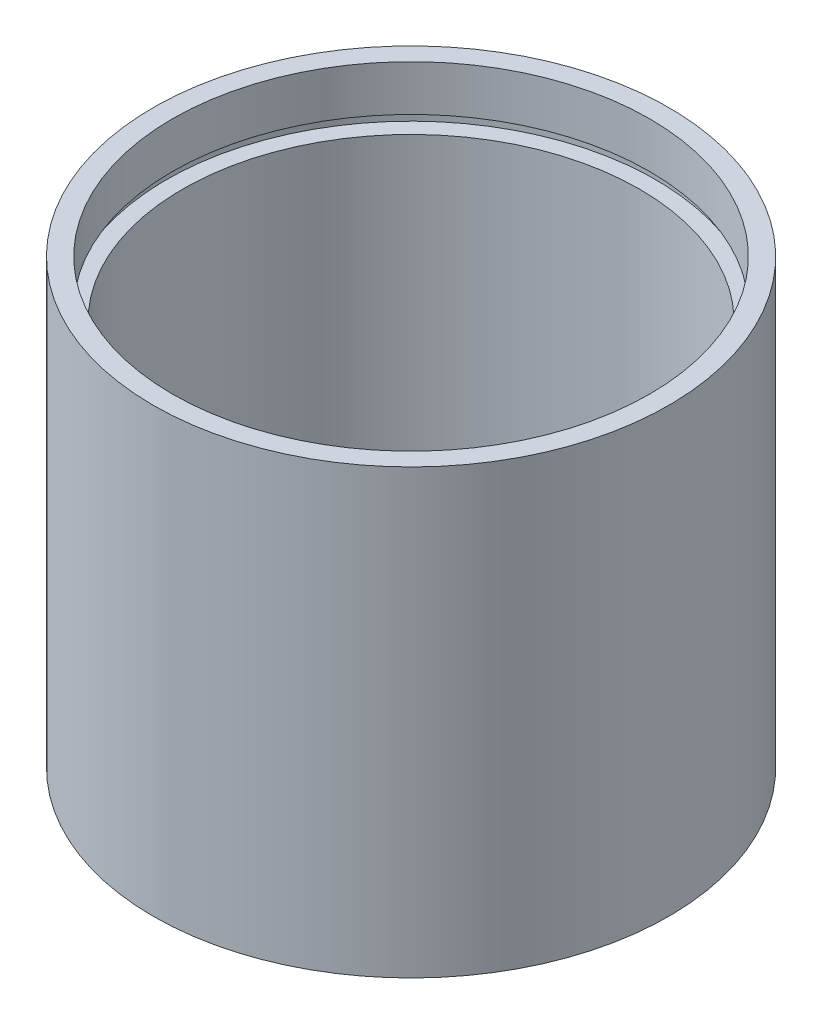
ISO-10303-21;
HEADER;
FILE_DESCRIPTION(('STEP AP214'),'2;1');
FILE_NAME('part.step','',(''),(''),'','','');
FILE_SCHEMA(('AUTOMOTIVE_DESIGN { 1 0 10303 214 1 1 1 1 }'));
ENDSEC;
DATA;
#1=APPLICATION_CONTEXT('core data for automotive mechanical design processes');
#2=APPLICATION_PROTOCOL_DEFINITION('international standard','automotive_design',2000,#1);
#3=PRODUCT_CONTEXT('',#1,'mechanical');
#4=PRODUCT('Part','Part','',(#3));
#5=PRODUCT_RELATED_PRODUCT_CATEGORY('part','',(#4));
#6=PRODUCT_DEFINITION_FORMATION('','',#4);
#7=PRODUCT_DEFINITION_CONTEXT('part definition',#1,'design');
#8=PRODUCT_DEFINITION('design','',#6,#7);
#9=PRODUCT_DEFINITION_SHAPE('','',#8);
#10=(LENGTH_UNIT() NAMED_UNIT(*) SI_UNIT(.MILLI.,.METRE.));
#11=(NAMED_UNIT(*) PLANE_ANGLE_UNIT() SI_UNIT($,.RADIAN.));
#12=(NAMED_UNIT(*) SI_UNIT($,.STERADIAN.) SOLID_ANGLE_UNIT());
#13=UNCERTAINTY_MEASURE_WITH_UNIT(LENGTH_MEASURE(1.E-05),#10,'distance_accuracy_value','');
#14=(GEOMETRIC_REPRESENTATION_CONTEXT(3) GLOBAL_UNCERTAINTY_ASSIGNED_CONTEXT((#13)) GLOBAL_UNIT_ASSIGNED_CONTEXT((#10,
#11,#12)) REPRESENTATION_CONTEXT('',''));
#15=CARTESIAN_POINT('',(0.,0.,0.));
#16=DIRECTION('',(0.,0.,1.));
#17=DIRECTION('',(1.,0.,0.));
#18=AXIS2_PLACEMENT_3D('',#15,#16,#17);
#19=CARTESIAN_POINT('',(23.5,0.,0.));
#20=DIRECTION('',(0.,1.,0.));
#21=DIRECTION('',(0.,0.,1.));
#22=AXIS2_PLACEMENT_3D('',#19,#20,#21);
#23=PLANE('',#22);
#24=CARTESIAN_POINT('',(0.,0.,0.));
#25=DIRECTION('',(0.,1.,0.));
#26=DIRECTION('',(0.,0.,1.));
#27=AXIS2_PLACEMENT_3D('',#24,#25,#26);
#28=CIRCLE('',#27,25.4);
#29=CARTESIAN_POINT('',(0.,0.,25.4));
#30=VERTEX_POINT('',#29);
#31=EDGE_CURVE('E10',#30,#30,#28,.T.);
#32=ORIENTED_EDGE('',*,*,#31,.F.);
#33=EDGE_LOOP('',(#32));
#34=FACE_BOUND('',#33,.T.);
#35=CARTESIAN_POINT('',(0.,0.,0.));
#36=DIRECTION('',(0.,1.,0.));
#37=DIRECTION('',(0.,0.,1.));
#38=AXIS2_PLACEMENT_3D('',#35,#36,#37);
#39=CIRCLE('',#38,23.5);
#40=CARTESIAN_POINT('',(0.,0.,23.5));
#41=VERTEX_POINT('',#40);
#42=EDGE_CURVE('E77',#41,#41,#39,.T.);
#43=ORIENTED_EDGE('',*,*,#42,.T.);
#44=EDGE_LOOP('',(#43));
#45=FACE_BOUND('',#44,.T.);
#46=ADVANCED_FACE('F37',(#34,#45),#23,.F.);
#47=CARTESIAN_POINT('',(0.,161.376166943427,0.));
#48=DIRECTION('',(0.,1.,0.));
#49=DIRECTION('',(0.,0.,1.));
#50=AXIS2_PLACEMENT_3D('',#47,#48,#49);
#51=CYLINDRICAL_SURFACE('',#50,25.4);
#52=CARTESIAN_POINT('',(0.,43.6,0.));
#53=DIRECTION('',(0.,1.,0.));
#54=DIRECTION('',(0.,0.,1.));
#55=AXIS2_PLACEMENT_3D('',#52,#53,#54);
#56=CIRCLE('',#55,25.4);
#57=CARTESIAN_POINT('',(0.,43.6,25.4));
#58=VERTEX_POINT('',#57);
#59=EDGE_CURVE('E43',#58,#58,#56,.T.);
#60=ORIENTED_EDGE('',*,*,#59,.F.);
#61=EDGE_LOOP('',(#60));
#62=FACE_BOUND('',#61,.T.);
#63=ORIENTED_EDGE('',*,*,#31,.T.);
#64=EDGE_LOOP('',(#63));
#65=FACE_BOUND('',#64,.T.);
#66=ADVANCED_FACE('F138',(#62,#65),#51,.T.);
#67=CARTESIAN_POINT('',(23.5,43.6,0.));
#68=DIRECTION('',(0.,-1.,0.));
#69=DIRECTION('',(0.,0.,-1.));
#70=AXIS2_PLACEMENT_3D('',#67,#68,#69);
#71=PLANE('',#70);
#72=CARTESIAN_POINT('',(0.,43.6,0.));
#73=DIRECTION('',(0.,1.,0.));
#74=DIRECTION('',(0.,0.,1.));
#75=AXIS2_PLACEMENT_3D('',#72,#73,#74);
#76=CIRCLE('',#75,23.5);
#77=CARTESIAN_POINT('',(0.,43.6,23.5));
#78=VERTEX_POINT('',#77);
#79=EDGE_CURVE('E47',#78,#78,#76,.T.);
#80=ORIENTED_EDGE('',*,*,#79,.F.);
#81=EDGE_LOOP('',(#80));
#82=FACE_BOUND('',#81,.T.);
#83=ORIENTED_EDGE('',*,*,#59,.T.);
#84=EDGE_LOOP('',(#83));
#85=FACE_BOUND('',#84,.T.);
#86=ADVANCED_FACE('F133',(#82,#85),#71,.F.);
#87=CARTESIAN_POINT('',(0.,161.376166943427,0.));
#88=DIRECTION('',(0.,1.,0.));
#89=DIRECTION('',(0.,0.,1.));
#90=AXIS2_PLACEMENT_3D('',#87,#88,#89);
#91=CYLINDRICAL_SURFACE('',#90,23.5);
#92=CARTESIAN_POINT('',(0.,39.1,0.));
#93=DIRECTION('',(0.,1.,0.));
#94=DIRECTION('',(0.,0.,1.));
#95=AXIS2_PLACEMENT_3D('',#92,#93,#94);
#96=CIRCLE('',#95,23.5);
#97=CARTESIAN_POINT('',(0.,39.1,23.5));
#98=VERTEX_POINT('',#97);
#99=EDGE_CURVE('E51',#98,#98,#96,.T.);
#100=ORIENTED_EDGE('',*,*,#99,.F.);
#101=EDGE_LOOP('',(#100));
#102=FACE_BOUND('',#101,.T.);
#103=ORIENTED_EDGE('',*,*,#79,.T.);
#104=EDGE_LOOP('',(#103));
#105=FACE_BOUND('',#104,.T.);
#106=ADVANCED_FACE('F127',(#102,#105),#91,.F.);
#107=CARTESIAN_POINT('',(24.1,39.1,0.));
#108=DIRECTION('',(0.,1.,0.));
#109=DIRECTION('',(0.,0.,1.));
#110=AXIS2_PLACEMENT_3D('',#107,#108,#109);
#111=PLANE('',#110);
#112=CARTESIAN_POINT('',(0.,39.1,0.));
#113=DIRECTION('',(0.,1.,0.));
#114=DIRECTION('',(0.,0.,1.));
#115=AXIS2_PLACEMENT_3D('',#112,#113,#114);
#116=CIRCLE('',#115,24.1);
#117=CARTESIAN_POINT('',(0.,39.1,24.1));
#118=VERTEX_POINT('',#117);
#119=EDGE_CURVE('E56',#118,#118,#116,.T.);
#120=ORIENTED_EDGE('',*,*,#119,.F.);
#121=EDGE_LOOP('',(#120));
#122=FACE_BOUND('',#121,.T.);
#123=ORIENTED_EDGE('',*,*,#99,.T.);
#124=EDGE_LOOP('',(#123));
#125=FACE_BOUND('',#124,.T.);
#126=ADVANCED_FACE('F121',(#122,#125),#111,.F.);
#127=CARTESIAN_POINT('',(0.,161.376166943427,0.));
#128=DIRECTION('',(0.,1.,0.));
#129=DIRECTION('',(0.,0.,1.));
#130=AXIS2_PLACEMENT_3D('',#127,#128,#129);
#131=CYLINDRICAL_SURFACE('',#130,24.1);
#132=CARTESIAN_POINT('',(0.,38.1,0.));
#133=DIRECTION('',(0.,1.,0.));
#134=DIRECTION('',(0.,0.,1.));
#135=AXIS2_PLACEMENT_3D('',#132,#133,#134);
#136=CIRCLE('',#135,24.1);
#137=CARTESIAN_POINT('',(0.,38.1,24.1));
#138=VERTEX_POINT('',#137);
#139=EDGE_CURVE('E59',#138,#138,#136,.T.);
#140=ORIENTED_EDGE('',*,*,#139,.F.);
#141=EDGE_LOOP('',(#140));
#142=FACE_BOUND('',#141,.T.);
#143=ORIENTED_EDGE('',*,*,#119,.T.);
#144=EDGE_LOOP('',(#143));
#145=FACE_BOUND('',#144,.T.);
#146=ADVANCED_FACE('F115',(#142,#145),#131,.F.);
#147=CARTESIAN_POINT('',(22.5,38.1,0.));
#148=DIRECTION('',(0.,-1.,0.));
#149=DIRECTION('',(0.,0.,-1.));
#150=AXIS2_PLACEMENT_3D('',#147,#148,#149);
#151=PLANE('',#150);
#152=CARTESIAN_POINT('',(0.,38.1,0.));
#153=DIRECTION('',(0.,1.,0.));
#154=DIRECTION('',(0.,0.,1.));
#155=AXIS2_PLACEMENT_3D('',#152,#153,#154);
#156=CIRCLE('',#155,22.5);
#157=CARTESIAN_POINT('',(0.,38.1,22.5));
#158=VERTEX_POINT('',#157);
#159=EDGE_CURVE('E62',#158,#158,#156,.T.);
#160=ORIENTED_EDGE('',*,*,#159,.F.);
#161=EDGE_LOOP('',(#160));
#162=FACE_BOUND('',#161,.T.);
#163=ORIENTED_EDGE('',*,*,#139,.T.);
#164=EDGE_LOOP('',(#163));
#165=FACE_BOUND('',#164,.T.);
#166=ADVANCED_FACE('F109',(#162,#165),#151,.F.);
#167=CARTESIAN_POINT('',(0.,161.376166943427,0.));
#168=DIRECTION('',(0.,1.,0.));
#169=DIRECTION('',(0.,0.,1.));
#170=AXIS2_PLACEMENT_3D('',#167,#168,#169);
#171=CYLINDRICAL_SURFACE('',#170,22.5);
#172=CARTESIAN_POINT('',(0.,5.49999999999998,0.));
#173=DIRECTION('',(0.,1.,0.));
#174=DIRECTION('',(0.,0.,1.));
#175=AXIS2_PLACEMENT_3D('',#172,#173,#174);
#176=CIRCLE('',#175,22.5);
#177=CARTESIAN_POINT('',(0.,5.49999999999998,22.5));
#178=VERTEX_POINT('',#177);
#179=EDGE_CURVE('E65',#178,#178,#176,.T.);
#180=ORIENTED_EDGE('',*,*,#179,.F.);
#181=EDGE_LOOP('',(#180));
#182=FACE_BOUND('',#181,.T.);
#183=ORIENTED_EDGE('',*,*,#159,.T.);
#184=EDGE_LOOP('',(#183));
#185=FACE_BOUND('',#184,.T.);
#186=ADVANCED_FACE('F103',(#182,#185),#171,.F.);
#187=CARTESIAN_POINT('',(22.5,5.49999999999998,0.));
#188=DIRECTION('',(0.,1.,0.));
#189=DIRECTION('',(0.,0.,1.));
#190=AXIS2_PLACEMENT_3D('',#187,#188,#189);
#191=PLANE('',#190);
#192=CARTESIAN_POINT('',(0.,5.49999999999998,0.));
#193=DIRECTION('',(0.,1.,0.));
#194=DIRECTION('',(0.,0.,1.));
#195=AXIS2_PLACEMENT_3D('',#192,#193,#194);
#196=CIRCLE('',#195,24.1);
#197=CARTESIAN_POINT('',(0.,5.49999999999998,24.1));
#198=VERTEX_POINT('',#197);
#199=EDGE_CURVE('E68',#198,#198,#196,.T.);
#200=ORIENTED_EDGE('',*,*,#199,.F.);
#201=EDGE_LOOP('',(#200));
#202=FACE_BOUND('',#201,.T.);
#203=ORIENTED_EDGE('',*,*,#179,.T.);
#204=EDGE_LOOP('',(#203));
#205=FACE_BOUND('',#204,.T.);
#206=ADVANCED_FACE('F97',(#202,#205),#191,.F.);
#207=CARTESIAN_POINT('',(0.,161.376166943427,0.));
#208=DIRECTION('',(0.,1.,0.));
#209=DIRECTION('',(0.,0.,1.));
#210=AXIS2_PLACEMENT_3D('',#207,#208,#209);
#211=CYLINDRICAL_SURFACE('',#210,24.1);
#212=CARTESIAN_POINT('',(0.,4.49999999999998,0.));
#213=DIRECTION('',(0.,1.,0.));
#214=DIRECTION('',(0.,0.,1.));
#215=AXIS2_PLACEMENT_3D('',#212,#213,#214);
#216=CIRCLE('',#215,24.1);
#217=CARTESIAN_POINT('',(0.,4.49999999999998,24.1));
#218=VERTEX_POINT('',#217);
#219=EDGE_CURVE('E71',#218,#218,#216,.T.);
#220=ORIENTED_EDGE('',*,*,#219,.F.);
#221=EDGE_LOOP('',(#220));
#222=FACE_BOUND('',#221,.T.);
#223=ORIENTED_EDGE('',*,*,#199,.T.);
#224=EDGE_LOOP('',(#223));
#225=FACE_BOUND('',#224,.T.);
#226=ADVANCED_FACE('F91',(#222,#225),#211,.F.);
#227=CARTESIAN_POINT('',(23.5,4.49999999999998,0.));
#228=DIRECTION('',(0.,-1.,0.));
#229=DIRECTION('',(0.,0.,-1.));
#230=AXIS2_PLACEMENT_3D('',#227,#228,#229);
#231=PLANE('',#230);
#232=CARTESIAN_POINT('',(0.,4.49999999999998,0.));
#233=DIRECTION('',(0.,1.,0.));
#234=DIRECTION('',(0.,0.,1.));
#235=AXIS2_PLACEMENT_3D('',#232,#233,#234);
#236=CIRCLE('',#235,23.5);
#237=CARTESIAN_POINT('',(0.,4.49999999999998,23.5));
#238=VERTEX_POINT('',#237);
#239=EDGE_CURVE('E74',#238,#238,#236,.T.);
#240=ORIENTED_EDGE('',*,*,#239,.F.);
#241=EDGE_LOOP('',(#240));
#242=FACE_BOUND('',#241,.T.);
#243=ORIENTED_EDGE('',*,*,#219,.T.);
#244=EDGE_LOOP('',(#243));
#245=FACE_BOUND('',#244,.T.);
#246=ADVANCED_FACE('F85',(#242,#245),#231,.F.);
#247=CARTESIAN_POINT('',(0.,161.376166943427,0.));
#248=DIRECTION('',(0.,1.,0.));
#249=DIRECTION('',(0.,0.,1.));
#250=AXIS2_PLACEMENT_3D('',#247,#248,#249);
#251=CYLINDRICAL_SURFACE('',#250,23.5);
#252=ORIENTED_EDGE('',*,*,#42,.F.);
#253=EDGE_LOOP('',(#252));
#254=FACE_BOUND('',#253,.T.);
#255=ORIENTED_EDGE('',*,*,#239,.T.);
#256=EDGE_LOOP('',(#255));
#257=FACE_BOUND('',#256,.T.);
#258=ADVANCED_FACE('F82',(#254,#257),#251,.F.);
#259=CLOSED_SHELL('',(#46,#66,#86,#106,#126,#146,#166,#186,#206,#226,#246,#258));
#260=MANIFOLD_SOLID_BREP('B2',#259);
#261=ADVANCED_BREP_SHAPE_REPRESENTATION('',(#18,#260),#14);
#262=SHAPE_DEFINITION_REPRESENTATION(#9,#261);
ENDSEC;
END-ISO-10303-21;
